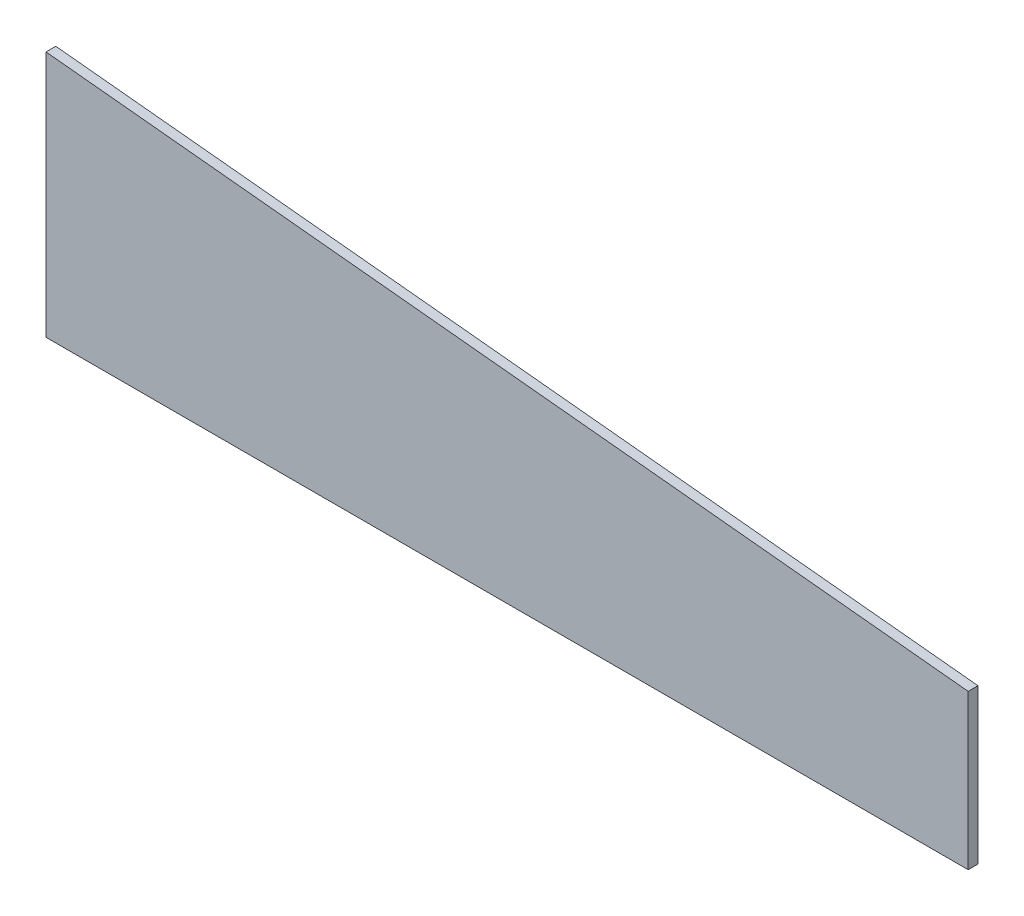
ISO-10303-21;
HEADER;
FILE_DESCRIPTION(('STEP AP214'),'2;1');
FILE_NAME('part.step','',(''),(''),'','','');
FILE_SCHEMA(('AUTOMOTIVE_DESIGN { 1 0 10303 214 1 1 1 1 }'));
ENDSEC;
DATA;
#1=APPLICATION_CONTEXT('core data for automotive mechanical design processes');
#2=APPLICATION_PROTOCOL_DEFINITION('international standard','automotive_design',2000,#1);
#3=PRODUCT_CONTEXT('',#1,'mechanical');
#4=PRODUCT('Part','Part','',(#3));
#5=PRODUCT_RELATED_PRODUCT_CATEGORY('part','',(#4));
#6=PRODUCT_DEFINITION_FORMATION('','',#4);
#7=PRODUCT_DEFINITION_CONTEXT('part definition',#1,'design');
#8=PRODUCT_DEFINITION('design','',#6,#7);
#9=PRODUCT_DEFINITION_SHAPE('','',#8);
#10=(LENGTH_UNIT() NAMED_UNIT(*) SI_UNIT(.MILLI.,.METRE.));
#11=(NAMED_UNIT(*) PLANE_ANGLE_UNIT() SI_UNIT($,.RADIAN.));
#12=(NAMED_UNIT(*) SI_UNIT($,.STERADIAN.) SOLID_ANGLE_UNIT());
#13=UNCERTAINTY_MEASURE_WITH_UNIT(LENGTH_MEASURE(1.E-05),#10,'distance_accuracy_value','');
#14=(GEOMETRIC_REPRESENTATION_CONTEXT(3) GLOBAL_UNCERTAINTY_ASSIGNED_CONTEXT((#13)) GLOBAL_UNIT_ASSIGNED_CONTEXT((#10,
#11,#12)) REPRESENTATION_CONTEXT('',''));
#15=CARTESIAN_POINT('',(0.,0.,0.));
#16=DIRECTION('',(0.,0.,1.));
#17=DIRECTION('',(1.,0.,0.));
#18=AXIS2_PLACEMENT_3D('',#15,#16,#17);
#19=CARTESIAN_POINT('',(0.,25.,1.5875));
#20=DIRECTION('',(-0.1,-0.99498743710662,0.));
#21=DIRECTION('',(0.99498743710662,-0.1,0.));
#22=AXIS2_PLACEMENT_3D('',#19,#20,#21);
#23=PLANE('',#22);
#24=DIRECTION('',(-0.99498743710662,0.1,0.));
#25=VECTOR('',#24,1.);
#26=CARTESIAN_POINT('',(0.,25.,0.));
#27=LINE('',#26,#25);
#28=CARTESIAN_POINT('',(0.,25.,0.));
#29=VERTEX_POINT('',#28);
#30=CARTESIAN_POINT('',(-149.248115565993,40.,0.));
#31=VERTEX_POINT('',#30);
#32=EDGE_CURVE('E96',#29,#31,#27,.T.);
#33=ORIENTED_EDGE('',*,*,#32,.T.);
#34=DIRECTION('',(0.,0.,-1.));
#35=VECTOR('',#34,1.);
#36=CARTESIAN_POINT('',(-149.248115565993,40.,1.5875));
#37=LINE('',#36,#35);
#38=CARTESIAN_POINT('',(-149.248115565993,40.,1.5875));
#39=VERTEX_POINT('',#38);
#40=EDGE_CURVE('E11',#39,#31,#37,.T.);
#41=ORIENTED_EDGE('',*,*,#40,.F.);
#42=DIRECTION('',(-0.99498743710662,0.1,0.));
#43=VECTOR('',#42,1.);
#44=CARTESIAN_POINT('',(0.,25.,1.5875));
#45=LINE('',#44,#43);
#46=CARTESIAN_POINT('',(0.,25.,1.5875));
#47=VERTEX_POINT('',#46);
#48=EDGE_CURVE('E84',#47,#39,#45,.T.);
#49=ORIENTED_EDGE('',*,*,#48,.F.);
#50=DIRECTION('',(0.,0.,-1.));
#51=VECTOR('',#50,1.);
#52=CARTESIAN_POINT('',(0.,25.,1.5875));
#53=LINE('',#52,#51);
#54=EDGE_CURVE('E92',#47,#29,#53,.T.);
#55=ORIENTED_EDGE('',*,*,#54,.T.);
#56=EDGE_LOOP('',(#33,#41,#49,#55));
#57=FACE_BOUND('',#56,.T.);
#58=ADVANCED_FACE('F33',(#57),#23,.F.);
#59=CARTESIAN_POINT('',(-149.248115565993,40.,1.5875));
#60=DIRECTION('',(1.,0.,0.));
#61=DIRECTION('',(0.,0.,-1.));
#62=AXIS2_PLACEMENT_3D('',#59,#60,#61);
#63=PLANE('',#62);
#64=DIRECTION('',(0.,-1.,0.));
#65=VECTOR('',#64,1.);
#66=CARTESIAN_POINT('',(-149.248115565993,40.,0.));
#67=LINE('',#66,#65);
#68=CARTESIAN_POINT('',(-149.248115565993,0.,0.));
#69=VERTEX_POINT('',#68);
#70=EDGE_CURVE('E88',#31,#69,#67,.T.);
#71=ORIENTED_EDGE('',*,*,#70,.T.);
#72=DIRECTION('',(0.,0.,-1.));
#73=VECTOR('',#72,1.);
#74=CARTESIAN_POINT('',(-149.248115565993,0.,1.5875));
#75=LINE('',#74,#73);
#76=CARTESIAN_POINT('',(-149.248115565993,0.,1.5875));
#77=VERTEX_POINT('',#76);
#78=EDGE_CURVE('E41',#77,#69,#75,.T.);
#79=ORIENTED_EDGE('',*,*,#78,.F.);
#80=DIRECTION('',(0.,-1.,0.));
#81=VECTOR('',#80,1.);
#82=CARTESIAN_POINT('',(-149.248115565993,40.,1.5875));
#83=LINE('',#82,#81);
#84=EDGE_CURVE('E79',#39,#77,#83,.T.);
#85=ORIENTED_EDGE('',*,*,#84,.F.);
#86=ORIENTED_EDGE('',*,*,#40,.T.);
#87=EDGE_LOOP('',(#71,#79,#85,#86));
#88=FACE_BOUND('',#87,.T.);
#89=ADVANCED_FACE('F87',(#88),#63,.F.);
#90=CARTESIAN_POINT('',(-149.248115565993,0.,1.5875));
#91=DIRECTION('',(0.,1.,0.));
#92=DIRECTION('',(0.,0.,1.));
#93=AXIS2_PLACEMENT_3D('',#90,#91,#92);
#94=PLANE('',#93);
#95=DIRECTION('',(1.,0.,0.));
#96=VECTOR('',#95,1.);
#97=CARTESIAN_POINT('',(-149.248115565993,0.,0.));
#98=LINE('',#97,#96);
#99=CARTESIAN_POINT('',(0.,0.,0.));
#100=VERTEX_POINT('',#99);
#101=EDGE_CURVE('E66',#69,#100,#98,.T.);
#102=ORIENTED_EDGE('',*,*,#101,.T.);
#103=DIRECTION('',(0.,0.,-1.));
#104=VECTOR('',#103,1.);
#105=CARTESIAN_POINT('',(0.,0.,1.5875));
#106=LINE('',#105,#104);
#107=CARTESIAN_POINT('',(0.,0.,1.5875));
#108=VERTEX_POINT('',#107);
#109=EDGE_CURVE('E89',#108,#100,#106,.T.);
#110=ORIENTED_EDGE('',*,*,#109,.F.);
#111=DIRECTION('',(1.,0.,0.));
#112=VECTOR('',#111,1.);
#113=CARTESIAN_POINT('',(-149.248115565993,0.,1.5875));
#114=LINE('',#113,#112);
#115=EDGE_CURVE('E82',#77,#108,#114,.T.);
#116=ORIENTED_EDGE('',*,*,#115,.F.);
#117=ORIENTED_EDGE('',*,*,#78,.T.);
#118=EDGE_LOOP('',(#102,#110,#116,#117));
#119=FACE_BOUND('',#118,.T.);
#120=ADVANCED_FACE('F90',(#119),#94,.F.);
#121=CARTESIAN_POINT('',(0.,0.,1.5875));
#122=DIRECTION('',(-1.,0.,0.));
#123=DIRECTION('',(0.,0.,1.));
#124=AXIS2_PLACEMENT_3D('',#121,#122,#123);
#125=PLANE('',#124);
#126=DIRECTION('',(0.,1.,0.));
#127=VECTOR('',#126,1.);
#128=CARTESIAN_POINT('',(0.,0.,0.));
#129=LINE('',#128,#127);
#130=EDGE_CURVE('E72',#100,#29,#129,.T.);
#131=ORIENTED_EDGE('',*,*,#130,.T.);
#132=ORIENTED_EDGE('',*,*,#54,.F.);
#133=DIRECTION('',(0.,1.,0.));
#134=VECTOR('',#133,1.);
#135=CARTESIAN_POINT('',(0.,0.,1.5875));
#136=LINE('',#135,#134);
#137=EDGE_CURVE('E49',#108,#47,#136,.T.);
#138=ORIENTED_EDGE('',*,*,#137,.F.);
#139=ORIENTED_EDGE('',*,*,#109,.T.);
#140=EDGE_LOOP('',(#131,#132,#138,#139));
#141=FACE_BOUND('',#140,.T.);
#142=ADVANCED_FACE('F103',(#141),#125,.F.);
#143=CARTESIAN_POINT('',(0.,0.,1.5875));
#144=DIRECTION('',(0.,0.,1.));
#145=DIRECTION('',(1.,0.,0.));
#146=AXIS2_PLACEMENT_3D('',#143,#144,#145);
#147=PLANE('',#146);
#148=ORIENTED_EDGE('',*,*,#48,.T.);
#149=ORIENTED_EDGE('',*,*,#84,.T.);
#150=ORIENTED_EDGE('',*,*,#115,.T.);
#151=ORIENTED_EDGE('',*,*,#137,.T.);
#152=EDGE_LOOP('',(#148,#149,#150,#151));
#153=FACE_BOUND('',#152,.T.);
#154=ADVANCED_FACE('F80',(#153),#147,.T.);
#155=CARTESIAN_POINT('',(0.,0.,0.));
#156=DIRECTION('',(0.,0.,1.));
#157=DIRECTION('',(1.,0.,0.));
#158=AXIS2_PLACEMENT_3D('',#155,#156,#157);
#159=PLANE('',#158);
#160=ORIENTED_EDGE('',*,*,#32,.F.);
#161=ORIENTED_EDGE('',*,*,#130,.F.);
#162=ORIENTED_EDGE('',*,*,#101,.F.);
#163=ORIENTED_EDGE('',*,*,#70,.F.);
#164=EDGE_LOOP('',(#160,#161,#162,#163));
#165=FACE_BOUND('',#164,.T.);
#166=ADVANCED_FACE('F106',(#165),#159,.F.);
#167=CLOSED_SHELL('',(#58,#89,#120,#142,#154,#166));
#168=MANIFOLD_SOLID_BREP('B2',#167);
#169=ADVANCED_BREP_SHAPE_REPRESENTATION('',(#18,#168),#14);
#170=SHAPE_DEFINITION_REPRESENTATION(#9,#169);
ENDSEC;
END-ISO-10303-21;
